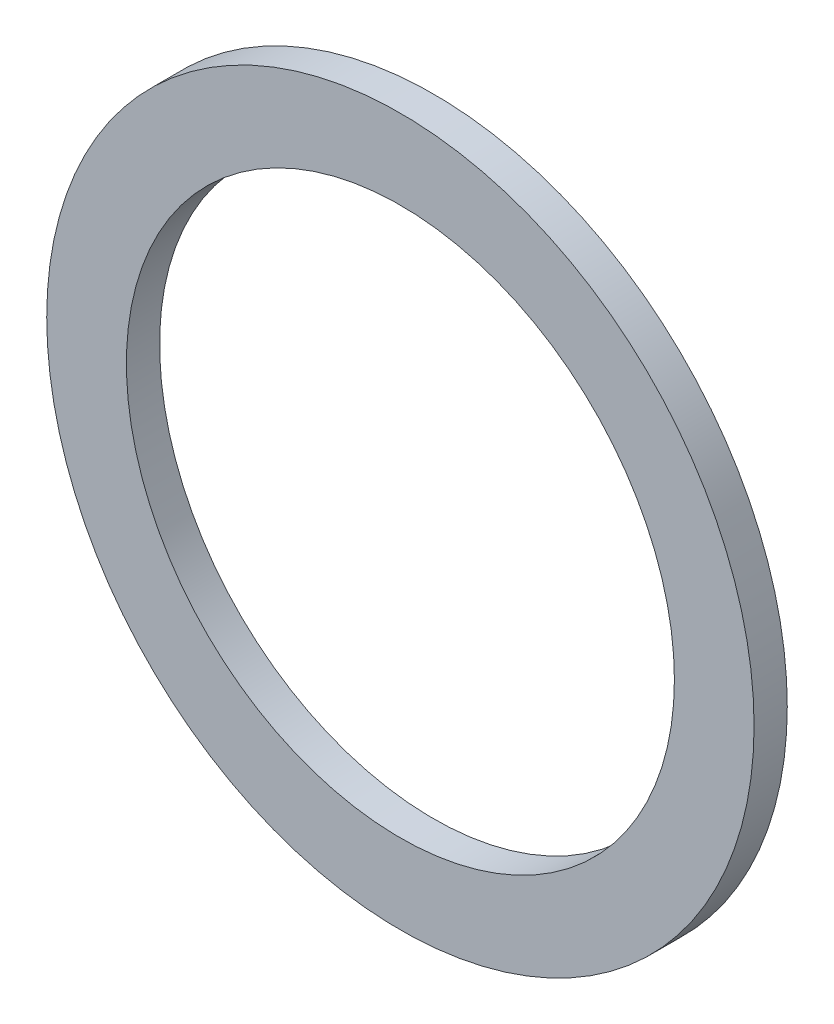
ISO-10303-21;
HEADER;
FILE_DESCRIPTION(('STEP AP214'),'2;1');
FILE_NAME('part.step','',(''),(''),'','','');
FILE_SCHEMA(('AUTOMOTIVE_DESIGN { 1 0 10303 214 1 1 1 1 }'));
ENDSEC;
DATA;
#1=APPLICATION_CONTEXT('core data for automotive mechanical design processes');
#2=APPLICATION_PROTOCOL_DEFINITION('international standard','automotive_design',2000,#1);
#3=PRODUCT_CONTEXT('',#1,'mechanical');
#4=PRODUCT('Part','Part','',(#3));
#5=PRODUCT_RELATED_PRODUCT_CATEGORY('part','',(#4));
#6=PRODUCT_DEFINITION_FORMATION('','',#4);
#7=PRODUCT_DEFINITION_CONTEXT('part definition',#1,'design');
#8=PRODUCT_DEFINITION('design','',#6,#7);
#9=PRODUCT_DEFINITION_SHAPE('','',#8);
#10=(LENGTH_UNIT() NAMED_UNIT(*) SI_UNIT(.MILLI.,.METRE.));
#11=(NAMED_UNIT(*) PLANE_ANGLE_UNIT() SI_UNIT($,.RADIAN.));
#12=(NAMED_UNIT(*) SI_UNIT($,.STERADIAN.) SOLID_ANGLE_UNIT());
#13=UNCERTAINTY_MEASURE_WITH_UNIT(LENGTH_MEASURE(1.E-05),#10,'distance_accuracy_value','');
#14=(GEOMETRIC_REPRESENTATION_CONTEXT(3) GLOBAL_UNCERTAINTY_ASSIGNED_CONTEXT((#13)) GLOBAL_UNIT_ASSIGNED_CONTEXT((#10,
#11,#12)) REPRESENTATION_CONTEXT('',''));
#15=CARTESIAN_POINT('',(0.,0.,0.));
#16=DIRECTION('',(0.,0.,1.));
#17=DIRECTION('',(1.,0.,0.));
#18=AXIS2_PLACEMENT_3D('',#15,#16,#17);
#19=CARTESIAN_POINT('',(0.,0.,0.5));
#20=DIRECTION('',(0.,0.,1.));
#21=DIRECTION('',(1.,0.,0.));
#22=AXIS2_PLACEMENT_3D('',#19,#20,#21);
#23=PLANE('',#22);
#24=CARTESIAN_POINT('',(0.,0.,0.5));
#25=DIRECTION('',(0.,0.,1.));
#26=DIRECTION('',(1.,0.,0.));
#27=AXIS2_PLACEMENT_3D('',#24,#25,#26);
#28=CIRCLE('',#27,5.327);
#29=CARTESIAN_POINT('',(5.327,0.,0.5));
#30=VERTEX_POINT('',#29);
#31=EDGE_CURVE('E10',#30,#30,#28,.T.);
#32=ORIENTED_EDGE('',*,*,#31,.T.);
#33=EDGE_LOOP('',(#32));
#34=FACE_BOUND('',#33,.T.);
#35=CARTESIAN_POINT('',(0.,0.,0.5));
#36=DIRECTION('',(0.,0.,1.));
#37=DIRECTION('',(1.,0.,0.));
#38=AXIS2_PLACEMENT_3D('',#35,#36,#37);
#39=CIRCLE('',#38,4.127);
#40=CARTESIAN_POINT('',(4.127,0.,0.5));
#41=VERTEX_POINT('',#40);
#42=EDGE_CURVE('E56',#41,#41,#39,.T.);
#43=ORIENTED_EDGE('',*,*,#42,.F.);
#44=EDGE_LOOP('',(#43));
#45=FACE_BOUND('',#44,.T.);
#46=ADVANCED_FACE('F43',(#34,#45),#23,.T.);
#47=CARTESIAN_POINT('',(0.,0.,0.));
#48=DIRECTION('',(0.,0.,1.));
#49=DIRECTION('',(1.,0.,0.));
#50=AXIS2_PLACEMENT_3D('',#47,#48,#49);
#51=PLANE('',#50);
#52=CARTESIAN_POINT('',(0.,0.,0.));
#53=DIRECTION('',(0.,0.,1.));
#54=DIRECTION('',(1.,0.,0.));
#55=AXIS2_PLACEMENT_3D('',#52,#53,#54);
#56=CIRCLE('',#55,5.327);
#57=CARTESIAN_POINT('',(5.327,0.,0.));
#58=VERTEX_POINT('',#57);
#59=EDGE_CURVE('E47',#58,#58,#56,.T.);
#60=ORIENTED_EDGE('',*,*,#59,.F.);
#61=EDGE_LOOP('',(#60));
#62=FACE_BOUND('',#61,.T.);
#63=CARTESIAN_POINT('',(0.,0.,0.));
#64=DIRECTION('',(0.,0.,1.));
#65=DIRECTION('',(1.,0.,0.));
#66=AXIS2_PLACEMENT_3D('',#63,#64,#65);
#67=CIRCLE('',#66,4.127);
#68=CARTESIAN_POINT('',(4.127,0.,0.));
#69=VERTEX_POINT('',#68);
#70=EDGE_CURVE('E58',#69,#69,#67,.T.);
#71=ORIENTED_EDGE('',*,*,#70,.T.);
#72=EDGE_LOOP('',(#71));
#73=FACE_BOUND('',#72,.T.);
#74=ADVANCED_FACE('F70',(#62,#73),#51,.F.);
#75=CARTESIAN_POINT('',(0.,0.,0.5));
#76=DIRECTION('',(0.,0.,-1.));
#77=DIRECTION('',(-1.,0.,0.));
#78=AXIS2_PLACEMENT_3D('',#75,#76,#77);
#79=CYLINDRICAL_SURFACE('',#78,5.327);
#80=ORIENTED_EDGE('',*,*,#31,.F.);
#81=EDGE_LOOP('',(#80));
#82=FACE_BOUND('',#81,.T.);
#83=ORIENTED_EDGE('',*,*,#59,.T.);
#84=EDGE_LOOP('',(#83));
#85=FACE_BOUND('',#84,.T.);
#86=ADVANCED_FACE('F45',(#82,#85),#79,.T.);
#87=CARTESIAN_POINT('',(0.,0.,0.5));
#88=DIRECTION('',(0.,0.,-1.));
#89=DIRECTION('',(-1.,0.,0.));
#90=AXIS2_PLACEMENT_3D('',#87,#88,#89);
#91=CYLINDRICAL_SURFACE('',#90,4.127);
#92=ORIENTED_EDGE('',*,*,#42,.T.);
#93=EDGE_LOOP('',(#92));
#94=FACE_BOUND('',#93,.T.);
#95=ORIENTED_EDGE('',*,*,#70,.F.);
#96=EDGE_LOOP('',(#95));
#97=FACE_BOUND('',#96,.T.);
#98=ADVANCED_FACE('F66',(#94,#97),#91,.F.);
#99=CLOSED_SHELL('',(#46,#74,#86,#98));
#100=MANIFOLD_SOLID_BREP('B2',#99);
#101=ADVANCED_BREP_SHAPE_REPRESENTATION('',(#18,#100),#14);
#102=SHAPE_DEFINITION_REPRESENTATION(#9,#101);
ENDSEC;
END-ISO-10303-21;
